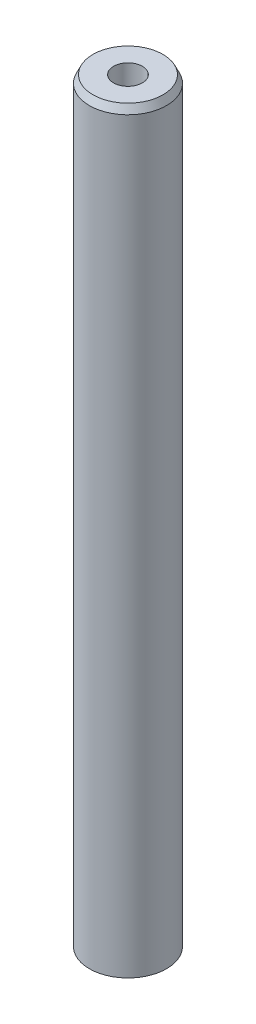
ISO-10303-21;
HEADER;
FILE_DESCRIPTION(('STEP AP214'),'2;1');
FILE_NAME('part.step','',(''),(''),'','','');
FILE_SCHEMA(('AUTOMOTIVE_DESIGN { 1 0 10303 214 1 1 1 1 }'));
ENDSEC;
DATA;
#1=APPLICATION_CONTEXT('core data for automotive mechanical design processes');
#2=APPLICATION_PROTOCOL_DEFINITION('international standard','automotive_design',2000,#1);
#3=PRODUCT_CONTEXT('',#1,'mechanical');
#4=PRODUCT('Part','Part','',(#3));
#5=PRODUCT_RELATED_PRODUCT_CATEGORY('part','',(#4));
#6=PRODUCT_DEFINITION_FORMATION('','',#4);
#7=PRODUCT_DEFINITION_CONTEXT('part definition',#1,'design');
#8=PRODUCT_DEFINITION('design','',#6,#7);
#9=PRODUCT_DEFINITION_SHAPE('','',#8);
#10=(LENGTH_UNIT() NAMED_UNIT(*) SI_UNIT(.MILLI.,.METRE.));
#11=(NAMED_UNIT(*) PLANE_ANGLE_UNIT() SI_UNIT($,.RADIAN.));
#12=(NAMED_UNIT(*) SI_UNIT($,.STERADIAN.) SOLID_ANGLE_UNIT());
#13=UNCERTAINTY_MEASURE_WITH_UNIT(LENGTH_MEASURE(1.E-05),#10,'distance_accuracy_value','');
#14=(GEOMETRIC_REPRESENTATION_CONTEXT(3) GLOBAL_UNCERTAINTY_ASSIGNED_CONTEXT((#13)) GLOBAL_UNIT_ASSIGNED_CONTEXT((#10,
#11,#12)) REPRESENTATION_CONTEXT('',''));
#15=CARTESIAN_POINT('',(0.,0.,0.));
#16=DIRECTION('',(0.,0.,1.));
#17=DIRECTION('',(1.,0.,0.));
#18=AXIS2_PLACEMENT_3D('',#15,#16,#17);
#19=CARTESIAN_POINT('',(0.,98.3009909796607,0.));
#20=DIRECTION('',(0.,-1.,0.));
#21=DIRECTION('',(0.,0.,-1.));
#22=AXIS2_PLACEMENT_3D('',#19,#20,#21);
#23=CYLINDRICAL_SURFACE('',#22,5.);
#24=CARTESIAN_POINT('',(0.,97.3228049866821,0.));
#25=DIRECTION('',(0.,1.,0.));
#26=DIRECTION('',(0.,0.,1.));
#27=AXIS2_PLACEMENT_3D('',#24,#25,#26);
#28=CIRCLE('',#27,5.);
#29=CARTESIAN_POINT('',(0.,97.3228049866821,5.));
#30=VERTEX_POINT('',#29);
#31=EDGE_CURVE('E50',#30,#30,#28,.F.);
#32=ORIENTED_EDGE('',*,*,#31,.T.);
#33=EDGE_LOOP('',(#32));
#34=FACE_BOUND('',#33,.T.);
#35=CARTESIAN_POINT('',(0.,0.462848859762555,0.));
#36=DIRECTION('',(0.,1.,0.));
#37=DIRECTION('',(0.,0.,1.));
#38=AXIS2_PLACEMENT_3D('',#35,#36,#37);
#39=CIRCLE('',#38,5.);
#40=CARTESIAN_POINT('',(0.,0.462848859762555,5.));
#41=VERTEX_POINT('',#40);
#42=EDGE_CURVE('E51',#41,#41,#39,.T.);
#43=ORIENTED_EDGE('',*,*,#42,.T.);
#44=EDGE_LOOP('',(#43));
#45=FACE_BOUND('',#44,.T.);
#46=ADVANCED_FACE('F39',(#34,#45),#23,.T.);
#47=CARTESIAN_POINT('',(0.,98.3009909796607,0.));
#48=DIRECTION('',(0.,1.,0.));
#49=DIRECTION('',(0.,0.,1.));
#50=AXIS2_PLACEMENT_3D('',#47,#48,#49);
#51=PLANE('',#50);
#52=CARTESIAN_POINT('',(0.,98.3009909796607,0.));
#53=DIRECTION('',(0.,1.,0.));
#54=DIRECTION('',(0.,0.,1.));
#55=AXIS2_PLACEMENT_3D('',#52,#53,#54);
#56=CIRCLE('',#55,4.53715114023742);
#57=CARTESIAN_POINT('',(0.,98.3009909796607,4.53715114023742));
#58=VERTEX_POINT('',#57);
#59=EDGE_CURVE('E54',#58,#58,#56,.T.);
#60=ORIENTED_EDGE('',*,*,#59,.T.);
#61=EDGE_LOOP('',(#60));
#62=FACE_BOUND('',#61,.T.);
#63=CARTESIAN_POINT('',(0.,98.3009909796607,0.));
#64=DIRECTION('',(0.,1.,0.));
#65=DIRECTION('',(0.,0.,1.));
#66=AXIS2_PLACEMENT_3D('',#63,#64,#65);
#67=CIRCLE('',#66,1.86729965048411);
#68=CARTESIAN_POINT('',(0.,98.3009909796607,1.86729965048411));
#69=VERTEX_POINT('',#68);
#70=EDGE_CURVE('E58',#69,#69,#67,.T.);
#71=ORIENTED_EDGE('',*,*,#70,.F.);
#72=EDGE_LOOP('',(#71));
#73=FACE_BOUND('',#72,.T.);
#74=ADVANCED_FACE('F69',(#62,#73),#51,.T.);
#75=CARTESIAN_POINT('',(0.,0.,0.));
#76=DIRECTION('',(0.,1.,0.));
#77=DIRECTION('',(0.,0.,1.));
#78=AXIS2_PLACEMENT_3D('',#75,#76,#77);
#79=PLANE('',#78);
#80=CARTESIAN_POINT('',(0.,0.,0.));
#81=DIRECTION('',(0.,1.,0.));
#82=DIRECTION('',(0.,0.,1.));
#83=AXIS2_PLACEMENT_3D('',#80,#81,#82);
#84=CIRCLE('',#83,4.02181400702137);
#85=CARTESIAN_POINT('',(0.,0.,4.02181400702137));
#86=VERTEX_POINT('',#85);
#87=EDGE_CURVE('E10',#86,#86,#84,.F.);
#88=ORIENTED_EDGE('',*,*,#87,.T.);
#89=EDGE_LOOP('',(#88));
#90=FACE_BOUND('',#89,.T.);
#91=CARTESIAN_POINT('',(0.,0.,0.));
#92=DIRECTION('',(0.,1.,0.));
#93=DIRECTION('',(0.,0.,1.));
#94=AXIS2_PLACEMENT_3D('',#91,#92,#93);
#95=CIRCLE('',#94,1.86729965048411);
#96=CARTESIAN_POINT('',(0.,0.,1.86729965048411));
#97=VERTEX_POINT('',#96);
#98=EDGE_CURVE('E63',#97,#97,#95,.T.);
#99=ORIENTED_EDGE('',*,*,#98,.T.);
#100=EDGE_LOOP('',(#99));
#101=FACE_BOUND('',#100,.T.);
#102=ADVANCED_FACE('F75',(#90,#101),#79,.F.);
#103=CARTESIAN_POINT('',(0.,98.3009909796607,0.));
#104=DIRECTION('',(0.,-1.,0.));
#105=DIRECTION('',(0.,0.,-1.));
#106=AXIS2_PLACEMENT_3D('',#103,#104,#105);
#107=CYLINDRICAL_SURFACE('',#106,1.86729965048411);
#108=ORIENTED_EDGE('',*,*,#70,.T.);
#109=EDGE_LOOP('',(#108));
#110=FACE_BOUND('',#109,.T.);
#111=ORIENTED_EDGE('',*,*,#98,.F.);
#112=EDGE_LOOP('',(#111));
#113=FACE_BOUND('',#112,.T.);
#114=ADVANCED_FACE('F70',(#110,#113),#107,.F.);
#115=CARTESIAN_POINT('',(0.,98.3009909796607,0.));
#116=DIRECTION('',(0.,-1.,0.));
#117=DIRECTION('',(0.,0.,-1.));
#118=AXIS2_PLACEMENT_3D('',#115,#116,#117);
#119=CONICAL_SURFACE('',#118,4.53715114023742,0.44195465777432);
#120=ORIENTED_EDGE('',*,*,#31,.F.);
#121=EDGE_LOOP('',(#120));
#122=FACE_BOUND('',#121,.T.);
#123=ORIENTED_EDGE('',*,*,#59,.F.);
#124=EDGE_LOOP('',(#123));
#125=FACE_BOUND('',#124,.T.);
#126=ADVANCED_FACE('F81',(#122,#125),#119,.T.);
#127=CARTESIAN_POINT('',(0.,0.462848859762555,0.));
#128=DIRECTION('',(0.,1.,0.));
#129=DIRECTION('',(0.,0.,1.));
#130=AXIS2_PLACEMENT_3D('',#127,#128,#129);
#131=CONICAL_SURFACE('',#130,5.,1.12884166902059);
#132=ORIENTED_EDGE('',*,*,#87,.F.);
#133=EDGE_LOOP('',(#132));
#134=FACE_BOUND('',#133,.T.);
#135=ORIENTED_EDGE('',*,*,#42,.F.);
#136=EDGE_LOOP('',(#135));
#137=FACE_BOUND('',#136,.T.);
#138=ADVANCED_FACE('F45',(#134,#137),#131,.T.);
#139=CLOSED_SHELL('',(#46,#74,#102,#114,#126,#138));
#140=MANIFOLD_SOLID_BREP('B2',#139);
#141=ADVANCED_BREP_SHAPE_REPRESENTATION('',(#18,#140),#14);
#142=SHAPE_DEFINITION_REPRESENTATION(#9,#141);
ENDSEC;
END-ISO-10303-21;
